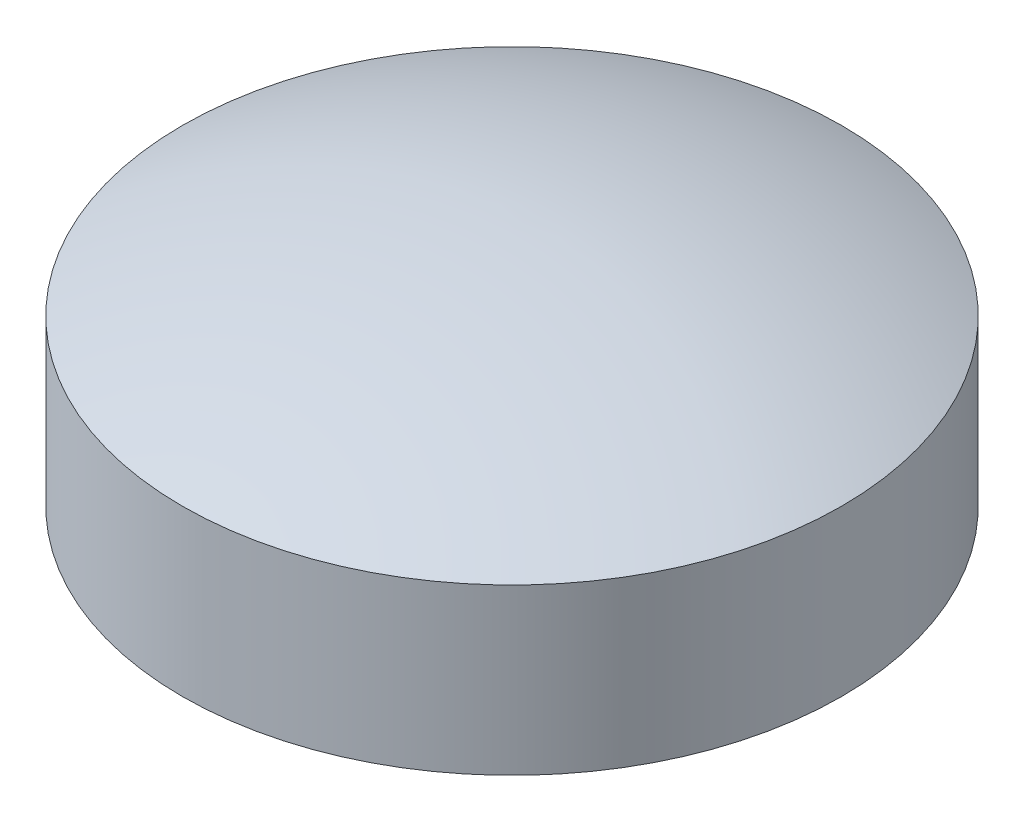
ISO-10303-21;
HEADER;
FILE_DESCRIPTION(('STEP AP214'),'2;1');
FILE_NAME('part.step','',(''),(''),'','','');
FILE_SCHEMA(('AUTOMOTIVE_DESIGN { 1 0 10303 214 1 1 1 1 }'));
ENDSEC;
DATA;
#1=APPLICATION_CONTEXT('core data for automotive mechanical design processes');
#2=APPLICATION_PROTOCOL_DEFINITION('international standard','automotive_design',2000,#1);
#3=PRODUCT_CONTEXT('',#1,'mechanical');
#4=PRODUCT('Part','Part','',(#3));
#5=PRODUCT_RELATED_PRODUCT_CATEGORY('part','',(#4));
#6=PRODUCT_DEFINITION_FORMATION('','',#4);
#7=PRODUCT_DEFINITION_CONTEXT('part definition',#1,'design');
#8=PRODUCT_DEFINITION('design','',#6,#7);
#9=PRODUCT_DEFINITION_SHAPE('','',#8);
#10=(LENGTH_UNIT() NAMED_UNIT(*) SI_UNIT(.MILLI.,.METRE.));
#11=(NAMED_UNIT(*) PLANE_ANGLE_UNIT() SI_UNIT($,.RADIAN.));
#12=(NAMED_UNIT(*) SI_UNIT($,.STERADIAN.) SOLID_ANGLE_UNIT());
#13=UNCERTAINTY_MEASURE_WITH_UNIT(LENGTH_MEASURE(1.E-05),#10,'distance_accuracy_value','');
#14=(GEOMETRIC_REPRESENTATION_CONTEXT(3) GLOBAL_UNCERTAINTY_ASSIGNED_CONTEXT((#13)) GLOBAL_UNIT_ASSIGNED_CONTEXT((#10,
#11,#12)) REPRESENTATION_CONTEXT('',''));
#15=CARTESIAN_POINT('',(0.,0.,0.));
#16=DIRECTION('',(0.,0.,1.));
#17=DIRECTION('',(1.,0.,0.));
#18=AXIS2_PLACEMENT_3D('',#15,#16,#17);
#19=CARTESIAN_POINT('',(0.,-35.,0.));
#20=DIRECTION('',(0.,1.,0.));
#21=DIRECTION('',(-1.,0.,0.));
#22=AXIS2_PLACEMENT_3D('',#19,#20,#21);
#23=SPHERICAL_SURFACE('',#22,70.);
#24=CARTESIAN_POINT('',(0.,28.2455532033676,0.));
#25=DIRECTION('',(0.,1.,0.));
#26=DIRECTION('',(-1.,0.,0.));
#27=AXIS2_PLACEMENT_3D('',#24,#25,#26);
#28=CIRCLE('',#27,30.);
#29=CARTESIAN_POINT('',(-30.,28.2455532033676,0.));
#30=VERTEX_POINT('',#29);
#31=EDGE_CURVE('E10',#30,#30,#28,.T.);
#32=ORIENTED_EDGE('',*,*,#31,.T.);
#33=EDGE_LOOP('',(#32));
#34=FACE_BOUND('',#33,.T.);
#35=ADVANCED_FACE('F31',(#34),#23,.T.);
#36=CARTESIAN_POINT('',(0.,35.,0.));
#37=DIRECTION('',(0.,1.,0.));
#38=DIRECTION('',(-1.,0.,0.));
#39=AXIS2_PLACEMENT_3D('',#36,#37,#38);
#40=CYLINDRICAL_SURFACE('',#39,30.);
#41=CARTESIAN_POINT('',(0.,13.2455532033676,0.));
#42=DIRECTION('',(0.,1.,0.));
#43=DIRECTION('',(-1.,0.,0.));
#44=AXIS2_PLACEMENT_3D('',#41,#42,#43);
#45=CIRCLE('',#44,30.);
#46=CARTESIAN_POINT('',(-30.,13.2455532033676,0.));
#47=VERTEX_POINT('',#46);
#48=EDGE_CURVE('E37',#47,#47,#45,.T.);
#49=ORIENTED_EDGE('',*,*,#48,.T.);
#50=EDGE_LOOP('',(#49));
#51=FACE_BOUND('',#50,.T.);
#52=ORIENTED_EDGE('',*,*,#31,.F.);
#53=EDGE_LOOP('',(#52));
#54=FACE_BOUND('',#53,.T.);
#55=ADVANCED_FACE('F43',(#51,#54),#40,.T.);
#56=CARTESIAN_POINT('',(-30.,13.2455532033676,0.));
#57=DIRECTION('',(0.,-1.,0.));
#58=DIRECTION('',(1.,0.,0.));
#59=AXIS2_PLACEMENT_3D('',#56,#57,#58);
#60=PLANE('',#59);
#61=ORIENTED_EDGE('',*,*,#48,.F.);
#62=EDGE_LOOP('',(#61));
#63=FACE_BOUND('',#62,.T.);
#64=ADVANCED_FACE('F46',(#63),#60,.T.);
#65=CLOSED_SHELL('',(#35,#55,#64));
#66=MANIFOLD_SOLID_BREP('B2',#65);
#67=ADVANCED_BREP_SHAPE_REPRESENTATION('',(#18,#66),#14);
#68=SHAPE_DEFINITION_REPRESENTATION(#9,#67);
ENDSEC;
END-ISO-10303-21;
